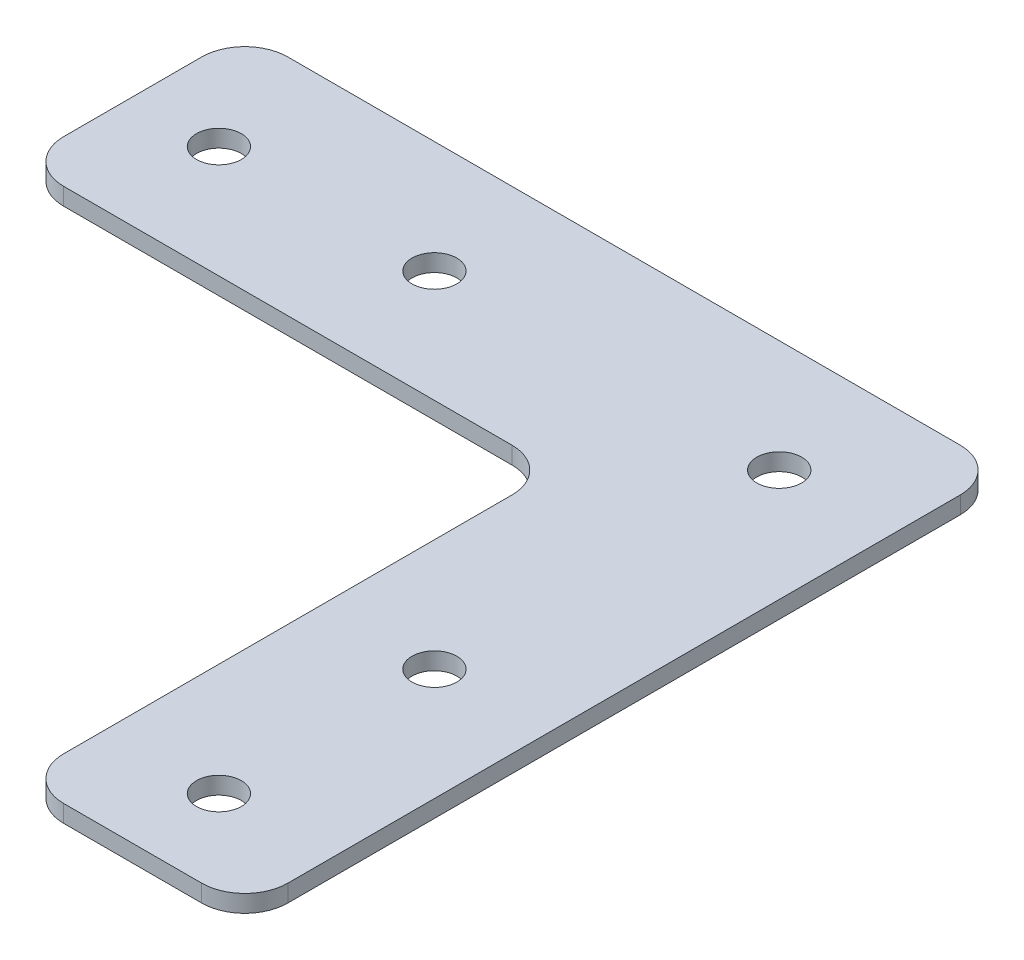
ISO-10303-21;
HEADER;
FILE_DESCRIPTION(('STEP AP214'),'2;1');
FILE_NAME('part.step','',(''),(''),'','','');
FILE_SCHEMA(('AUTOMOTIVE_DESIGN { 1 0 10303 214 1 1 1 1 }'));
ENDSEC;
DATA;
#1=APPLICATION_CONTEXT('core data for automotive mechanical design processes');
#2=APPLICATION_PROTOCOL_DEFINITION('international standard','automotive_design',2000,#1);
#3=PRODUCT_CONTEXT('',#1,'mechanical');
#4=PRODUCT('Part','Part','',(#3));
#5=PRODUCT_RELATED_PRODUCT_CATEGORY('part','',(#4));
#6=PRODUCT_DEFINITION_FORMATION('','',#4);
#7=PRODUCT_DEFINITION_CONTEXT('part definition',#1,'design');
#8=PRODUCT_DEFINITION('design','',#6,#7);
#9=PRODUCT_DEFINITION_SHAPE('','',#8);
#10=(LENGTH_UNIT() NAMED_UNIT(*) SI_UNIT(.MILLI.,.METRE.));
#11=(NAMED_UNIT(*) PLANE_ANGLE_UNIT() SI_UNIT($,.RADIAN.));
#12=(NAMED_UNIT(*) SI_UNIT($,.STERADIAN.) SOLID_ANGLE_UNIT());
#13=UNCERTAINTY_MEASURE_WITH_UNIT(LENGTH_MEASURE(1.E-05),#10,'distance_accuracy_value','');
#14=(GEOMETRIC_REPRESENTATION_CONTEXT(3) GLOBAL_UNCERTAINTY_ASSIGNED_CONTEXT((#13)) GLOBAL_UNIT_ASSIGNED_CONTEXT((#10,
#11,#12)) REPRESENTATION_CONTEXT('',''));
#15=CARTESIAN_POINT('',(0.,0.,0.));
#16=DIRECTION('',(0.,0.,1.));
#17=DIRECTION('',(1.,0.,0.));
#18=AXIS2_PLACEMENT_3D('',#15,#16,#17);
#19=CARTESIAN_POINT('',(8.,2.,-8.00000000000002));
#20=DIRECTION('',(0.,-1.,0.));
#21=DIRECTION('',(0.,0.,-1.));
#22=AXIS2_PLACEMENT_3D('',#19,#20,#21);
#23=PLANE('',#22);
#24=CARTESIAN_POINT('',(0.,2.,65.));
#25=DIRECTION('',(0.,-1.,0.));
#26=DIRECTION('',(0.,0.,-1.));
#27=AXIS2_PLACEMENT_3D('',#24,#25,#26);
#28=CIRCLE('',#27,2.6);
#29=CARTESIAN_POINT('',(0.,2.,62.4));
#30=VERTEX_POINT('',#29);
#31=EDGE_CURVE('E179',#30,#30,#28,.T.);
#32=ORIENTED_EDGE('',*,*,#31,.T.);
#33=EDGE_LOOP('',(#32));
#34=FACE_BOUND('',#33,.T.);
#35=CARTESIAN_POINT('',(0.,2.,40.));
#36=DIRECTION('',(0.,-1.,0.));
#37=DIRECTION('',(0.,0.,-1.));
#38=AXIS2_PLACEMENT_3D('',#35,#36,#37);
#39=CIRCLE('',#38,2.6);
#40=CARTESIAN_POINT('',(0.,2.,37.4));
#41=VERTEX_POINT('',#40);
#42=EDGE_CURVE('E182',#41,#41,#39,.T.);
#43=ORIENTED_EDGE('',*,*,#42,.T.);
#44=EDGE_LOOP('',(#43));
#45=FACE_BOUND('',#44,.T.);
#46=CARTESIAN_POINT('',(-40.,2.,0.));
#47=DIRECTION('',(0.,-1.,0.));
#48=DIRECTION('',(0.,0.,-1.));
#49=AXIS2_PLACEMENT_3D('',#46,#47,#48);
#50=CIRCLE('',#49,2.6);
#51=CARTESIAN_POINT('',(-40.,2.,-2.59999999999999));
#52=VERTEX_POINT('',#51);
#53=EDGE_CURVE('E185',#52,#52,#50,.T.);
#54=ORIENTED_EDGE('',*,*,#53,.T.);
#55=EDGE_LOOP('',(#54));
#56=FACE_BOUND('',#55,.T.);
#57=CARTESIAN_POINT('',(-65.,2.,0.));
#58=DIRECTION('',(0.,-1.,0.));
#59=DIRECTION('',(0.,0.,-1.));
#60=AXIS2_PLACEMENT_3D('',#57,#58,#59);
#61=CIRCLE('',#60,2.6);
#62=CARTESIAN_POINT('',(-65.,2.,-2.6));
#63=VERTEX_POINT('',#62);
#64=EDGE_CURVE('E188',#63,#63,#61,.T.);
#65=ORIENTED_EDGE('',*,*,#64,.T.);
#66=EDGE_LOOP('',(#65));
#67=FACE_BOUND('',#66,.T.);
#68=CARTESIAN_POINT('',(0.,2.,0.));
#69=DIRECTION('',(0.,-1.,0.));
#70=DIRECTION('',(0.,0.,-1.));
#71=AXIS2_PLACEMENT_3D('',#68,#69,#70);
#72=CIRCLE('',#71,2.6);
#73=CARTESIAN_POINT('',(0.,2.,-2.6));
#74=VERTEX_POINT('',#73);
#75=EDGE_CURVE('E123',#74,#74,#72,.T.);
#76=ORIENTED_EDGE('',*,*,#75,.T.);
#77=EDGE_LOOP('',(#76));
#78=FACE_BOUND('',#77,.T.);
#79=DIRECTION('',(1.,0.,0.));
#80=VECTOR('',#79,1.);
#81=CARTESIAN_POINT('',(8.,2.,-13.));
#82=LINE('',#81,#80);
#83=CARTESIAN_POINT('',(8.,2.,-13.));
#84=VERTEX_POINT('',#83);
#85=CARTESIAN_POINT('',(-70.,2.,-13.));
#86=VERTEX_POINT('',#85);
#87=EDGE_CURVE('E107',#84,#86,#82,.F.);
#88=ORIENTED_EDGE('',*,*,#87,.T.);
#89=CARTESIAN_POINT('',(-70.,2.,-7.99999999999999));
#90=DIRECTION('',(0.,-1.,0.));
#91=DIRECTION('',(0.,0.,-1.));
#92=AXIS2_PLACEMENT_3D('',#89,#90,#91);
#93=CIRCLE('',#92,5.00000000000001);
#94=CARTESIAN_POINT('',(-75.,2.,-8.));
#95=VERTEX_POINT('',#94);
#96=EDGE_CURVE('E119',#95,#86,#93,.T.);
#97=ORIENTED_EDGE('',*,*,#96,.F.);
#98=DIRECTION('',(0.,0.,-1.));
#99=VECTOR('',#98,1.);
#100=CARTESIAN_POINT('',(-75.,2.,8.00000000000001));
#101=LINE('',#100,#99);
#102=CARTESIAN_POINT('',(-75.,2.,8.00000000000001));
#103=VERTEX_POINT('',#102);
#104=EDGE_CURVE('E129',#95,#103,#101,.F.);
#105=ORIENTED_EDGE('',*,*,#104,.T.);
#106=CARTESIAN_POINT('',(-70.,2.,8.00000000000001));
#107=DIRECTION('',(0.,-1.,0.));
#108=DIRECTION('',(0.,0.,-1.));
#109=AXIS2_PLACEMENT_3D('',#106,#107,#108);
#110=CIRCLE('',#109,5.);
#111=CARTESIAN_POINT('',(-70.,2.,13.));
#112=VERTEX_POINT('',#111);
#113=EDGE_CURVE('E132',#112,#103,#110,.T.);
#114=ORIENTED_EDGE('',*,*,#113,.F.);
#115=DIRECTION('',(-1.,0.,0.));
#116=VECTOR('',#115,1.);
#117=CARTESIAN_POINT('',(-70.,2.,13.));
#118=LINE('',#117,#116);
#119=CARTESIAN_POINT('',(-18.,2.,13.));
#120=VERTEX_POINT('',#119);
#121=EDGE_CURVE('E133',#112,#120,#118,.F.);
#122=ORIENTED_EDGE('',*,*,#121,.T.);
#123=CARTESIAN_POINT('',(-18.,2.,18.));
#124=DIRECTION('',(0.,-1.,0.));
#125=DIRECTION('',(0.,0.,-1.));
#126=AXIS2_PLACEMENT_3D('',#123,#124,#125);
#127=CIRCLE('',#126,5.);
#128=CARTESIAN_POINT('',(-13.,2.,18.));
#129=VERTEX_POINT('',#128);
#130=EDGE_CURVE('E198',#120,#129,#127,.T.);
#131=ORIENTED_EDGE('',*,*,#130,.T.);
#132=DIRECTION('',(0.,0.,-1.));
#133=VECTOR('',#132,1.);
#134=CARTESIAN_POINT('',(-13.,2.,18.));
#135=LINE('',#134,#133);
#136=CARTESIAN_POINT('',(-13.,2.,70.));
#137=VERTEX_POINT('',#136);
#138=EDGE_CURVE('E137',#129,#137,#135,.F.);
#139=ORIENTED_EDGE('',*,*,#138,.T.);
#140=CARTESIAN_POINT('',(-8.,2.,70.));
#141=DIRECTION('',(0.,-1.,0.));
#142=DIRECTION('',(0.,0.,-1.));
#143=AXIS2_PLACEMENT_3D('',#140,#141,#142);
#144=CIRCLE('',#143,5.);
#145=CARTESIAN_POINT('',(-8.,2.,75.));
#146=VERTEX_POINT('',#145);
#147=EDGE_CURVE('E140',#146,#137,#144,.T.);
#148=ORIENTED_EDGE('',*,*,#147,.F.);
#149=DIRECTION('',(-1.,0.,0.));
#150=VECTOR('',#149,1.);
#151=CARTESIAN_POINT('',(8.,2.,75.));
#152=LINE('',#151,#150);
#153=CARTESIAN_POINT('',(8.,2.,75.));
#154=VERTEX_POINT('',#153);
#155=EDGE_CURVE('E141',#146,#154,#152,.F.);
#156=ORIENTED_EDGE('',*,*,#155,.T.);
#157=CARTESIAN_POINT('',(8.,2.,70.));
#158=DIRECTION('',(0.,-1.,0.));
#159=DIRECTION('',(0.,0.,-1.));
#160=AXIS2_PLACEMENT_3D('',#157,#158,#159);
#161=CIRCLE('',#160,5.);
#162=CARTESIAN_POINT('',(13.,2.,70.));
#163=VERTEX_POINT('',#162);
#164=EDGE_CURVE('E144',#163,#154,#161,.T.);
#165=ORIENTED_EDGE('',*,*,#164,.F.);
#166=DIRECTION('',(0.,0.,1.));
#167=VECTOR('',#166,1.);
#168=CARTESIAN_POINT('',(13.,2.,70.));
#169=LINE('',#168,#167);
#170=CARTESIAN_POINT('',(13.,2.,-8.00000000000002));
#171=VERTEX_POINT('',#170);
#172=EDGE_CURVE('E109',#163,#171,#169,.F.);
#173=ORIENTED_EDGE('',*,*,#172,.T.);
#174=CARTESIAN_POINT('',(8.,2.,-8.00000000000002));
#175=DIRECTION('',(0.,-1.,0.));
#176=DIRECTION('',(0.,0.,-1.));
#177=AXIS2_PLACEMENT_3D('',#174,#175,#176);
#178=CIRCLE('',#177,5.);
#179=EDGE_CURVE('E20',#84,#171,#178,.T.);
#180=ORIENTED_EDGE('',*,*,#179,.F.);
#181=EDGE_LOOP('',(#88,#97,#105,#114,#122,#131,#139,#148,#156,#165,#173,#180));
#182=FACE_BOUND('',#181,.T.);
#183=ADVANCED_FACE('F17',(#34,#45,#56,#67,#78,#182),#23,.F.);
#184=CARTESIAN_POINT('',(8.,2.,-8.00000000000002));
#185=DIRECTION('',(0.,-1.,0.));
#186=DIRECTION('',(0.,0.,-1.));
#187=AXIS2_PLACEMENT_3D('',#184,#185,#186);
#188=CYLINDRICAL_SURFACE('',#187,5.);
#189=DIRECTION('',(0.,1.,0.));
#190=VECTOR('',#189,1.);
#191=CARTESIAN_POINT('',(8.,2.,-13.));
#192=LINE('',#191,#190);
#193=CARTESIAN_POINT('',(8.,0.,-13.));
#194=VERTEX_POINT('',#193);
#195=EDGE_CURVE('E113',#194,#84,#192,.T.);
#196=ORIENTED_EDGE('',*,*,#195,.T.);
#197=ORIENTED_EDGE('',*,*,#179,.T.);
#198=DIRECTION('',(0.,1.,0.));
#199=VECTOR('',#198,1.);
#200=CARTESIAN_POINT('',(13.,2.,-8.00000000000002));
#201=LINE('',#200,#199);
#202=CARTESIAN_POINT('',(13.,0.,-8.00000000000002));
#203=VERTEX_POINT('',#202);
#204=EDGE_CURVE('E127',#171,#203,#201,.F.);
#205=ORIENTED_EDGE('',*,*,#204,.T.);
#206=CARTESIAN_POINT('',(8.,0.,-8.00000000000002));
#207=DIRECTION('',(0.,-1.,0.));
#208=DIRECTION('',(0.,0.,-1.));
#209=AXIS2_PLACEMENT_3D('',#206,#207,#208);
#210=CIRCLE('',#209,5.);
#211=EDGE_CURVE('E116',#194,#203,#210,.T.);
#212=ORIENTED_EDGE('',*,*,#211,.F.);
#213=EDGE_LOOP('',(#196,#197,#205,#212));
#214=FACE_BOUND('',#213,.T.);
#215=ADVANCED_FACE('F114',(#214),#188,.T.);
#216=CARTESIAN_POINT('',(13.,2.,70.));
#217=DIRECTION('',(-1.,0.,0.));
#218=DIRECTION('',(0.,0.,1.));
#219=AXIS2_PLACEMENT_3D('',#216,#217,#218);
#220=PLANE('',#219);
#221=DIRECTION('',(0.,0.,-1.));
#222=VECTOR('',#221,1.);
#223=CARTESIAN_POINT('',(13.,0.,-8.00000000000002));
#224=LINE('',#223,#222);
#225=CARTESIAN_POINT('',(13.,0.,70.));
#226=VERTEX_POINT('',#225);
#227=EDGE_CURVE('E177',#203,#226,#224,.F.);
#228=ORIENTED_EDGE('',*,*,#227,.F.);
#229=ORIENTED_EDGE('',*,*,#204,.F.);
#230=ORIENTED_EDGE('',*,*,#172,.F.);
#231=DIRECTION('',(0.,-1.,0.));
#232=VECTOR('',#231,1.);
#233=CARTESIAN_POINT('',(13.,2.,70.));
#234=LINE('',#233,#232);
#235=EDGE_CURVE('E203',#226,#163,#234,.F.);
#236=ORIENTED_EDGE('',*,*,#235,.F.);
#237=EDGE_LOOP('',(#228,#229,#230,#236));
#238=FACE_BOUND('',#237,.T.);
#239=ADVANCED_FACE('F265',(#238),#220,.F.);
#240=CARTESIAN_POINT('',(8.,2.,70.));
#241=DIRECTION('',(0.,-1.,0.));
#242=DIRECTION('',(0.,0.,-1.));
#243=AXIS2_PLACEMENT_3D('',#240,#241,#242);
#244=CYLINDRICAL_SURFACE('',#243,5.);
#245=ORIENTED_EDGE('',*,*,#235,.T.);
#246=ORIENTED_EDGE('',*,*,#164,.T.);
#247=DIRECTION('',(0.,1.,0.));
#248=VECTOR('',#247,1.);
#249=CARTESIAN_POINT('',(8.,2.,75.));
#250=LINE('',#249,#248);
#251=CARTESIAN_POINT('',(8.,0.,75.));
#252=VERTEX_POINT('',#251);
#253=EDGE_CURVE('E143',#154,#252,#250,.F.);
#254=ORIENTED_EDGE('',*,*,#253,.T.);
#255=CARTESIAN_POINT('',(8.,0.,70.));
#256=DIRECTION('',(0.,-1.,0.));
#257=DIRECTION('',(0.,0.,-1.));
#258=AXIS2_PLACEMENT_3D('',#255,#256,#257);
#259=CIRCLE('',#258,5.);
#260=EDGE_CURVE('E174',#226,#252,#259,.T.);
#261=ORIENTED_EDGE('',*,*,#260,.F.);
#262=EDGE_LOOP('',(#245,#246,#254,#261));
#263=FACE_BOUND('',#262,.T.);
#264=ADVANCED_FACE('F262',(#263),#244,.T.);
#265=CARTESIAN_POINT('',(8.,2.,75.));
#266=DIRECTION('',(0.,0.,-1.));
#267=DIRECTION('',(-1.,0.,0.));
#268=AXIS2_PLACEMENT_3D('',#265,#266,#267);
#269=PLANE('',#268);
#270=DIRECTION('',(1.,0.,0.));
#271=VECTOR('',#270,1.);
#272=CARTESIAN_POINT('',(8.,0.,75.));
#273=LINE('',#272,#271);
#274=CARTESIAN_POINT('',(-8.,0.,75.));
#275=VERTEX_POINT('',#274);
#276=EDGE_CURVE('E173',#252,#275,#273,.F.);
#277=ORIENTED_EDGE('',*,*,#276,.F.);
#278=ORIENTED_EDGE('',*,*,#253,.F.);
#279=ORIENTED_EDGE('',*,*,#155,.F.);
#280=DIRECTION('',(0.,-1.,0.));
#281=VECTOR('',#280,1.);
#282=CARTESIAN_POINT('',(-8.,2.,75.));
#283=LINE('',#282,#281);
#284=EDGE_CURVE('E201',#275,#146,#283,.F.);
#285=ORIENTED_EDGE('',*,*,#284,.F.);
#286=EDGE_LOOP('',(#277,#278,#279,#285));
#287=FACE_BOUND('',#286,.T.);
#288=ADVANCED_FACE('F261',(#287),#269,.F.);
#289=CARTESIAN_POINT('',(-8.,2.,70.));
#290=DIRECTION('',(0.,-1.,0.));
#291=DIRECTION('',(0.,0.,-1.));
#292=AXIS2_PLACEMENT_3D('',#289,#290,#291);
#293=CYLINDRICAL_SURFACE('',#292,5.);
#294=ORIENTED_EDGE('',*,*,#284,.T.);
#295=ORIENTED_EDGE('',*,*,#147,.T.);
#296=DIRECTION('',(0.,1.,0.));
#297=VECTOR('',#296,1.);
#298=CARTESIAN_POINT('',(-13.,2.,70.));
#299=LINE('',#298,#297);
#300=CARTESIAN_POINT('',(-13.,0.,70.));
#301=VERTEX_POINT('',#300);
#302=EDGE_CURVE('E139',#137,#301,#299,.F.);
#303=ORIENTED_EDGE('',*,*,#302,.T.);
#304=CARTESIAN_POINT('',(-8.,0.,70.));
#305=DIRECTION('',(0.,-1.,0.));
#306=DIRECTION('',(0.,0.,-1.));
#307=AXIS2_PLACEMENT_3D('',#304,#305,#306);
#308=CIRCLE('',#307,5.);
#309=EDGE_CURVE('E170',#275,#301,#308,.T.);
#310=ORIENTED_EDGE('',*,*,#309,.F.);
#311=EDGE_LOOP('',(#294,#295,#303,#310));
#312=FACE_BOUND('',#311,.T.);
#313=ADVANCED_FACE('F257',(#312),#293,.T.);
#314=CARTESIAN_POINT('',(-13.,2.,18.));
#315=DIRECTION('',(1.,0.,0.));
#316=DIRECTION('',(0.,0.,-1.));
#317=AXIS2_PLACEMENT_3D('',#314,#315,#316);
#318=PLANE('',#317);
#319=DIRECTION('',(0.,0.,-1.));
#320=VECTOR('',#319,1.);
#321=CARTESIAN_POINT('',(-13.,0.,-8.00000000000002));
#322=LINE('',#321,#320);
#323=CARTESIAN_POINT('',(-13.,0.,18.));
#324=VERTEX_POINT('',#323);
#325=EDGE_CURVE('E169',#301,#324,#322,.T.);
#326=ORIENTED_EDGE('',*,*,#325,.F.);
#327=ORIENTED_EDGE('',*,*,#302,.F.);
#328=ORIENTED_EDGE('',*,*,#138,.F.);
#329=DIRECTION('',(0.,-1.,0.));
#330=VECTOR('',#329,1.);
#331=CARTESIAN_POINT('',(-13.,2.,18.));
#332=LINE('',#331,#330);
#333=EDGE_CURVE('E136',#129,#324,#332,.T.);
#334=ORIENTED_EDGE('',*,*,#333,.T.);
#335=EDGE_LOOP('',(#326,#327,#328,#334));
#336=FACE_BOUND('',#335,.T.);
#337=ADVANCED_FACE('F253',(#336),#318,.F.);
#338=CARTESIAN_POINT('',(-18.,2.,18.));
#339=DIRECTION('',(0.,-1.,0.));
#340=DIRECTION('',(0.,0.,-1.));
#341=AXIS2_PLACEMENT_3D('',#338,#339,#340);
#342=CYLINDRICAL_SURFACE('',#341,5.);
#343=CARTESIAN_POINT('',(-18.,0.,18.));
#344=DIRECTION('',(0.,-1.,0.));
#345=DIRECTION('',(0.,0.,-1.));
#346=AXIS2_PLACEMENT_3D('',#343,#344,#345);
#347=CIRCLE('',#346,5.);
#348=CARTESIAN_POINT('',(-18.,0.,13.));
#349=VERTEX_POINT('',#348);
#350=EDGE_CURVE('E166',#324,#349,#347,.F.);
#351=ORIENTED_EDGE('',*,*,#350,.F.);
#352=ORIENTED_EDGE('',*,*,#333,.F.);
#353=ORIENTED_EDGE('',*,*,#130,.F.);
#354=DIRECTION('',(0.,1.,0.));
#355=VECTOR('',#354,1.);
#356=CARTESIAN_POINT('',(-18.,2.,13.));
#357=LINE('',#356,#355);
#358=EDGE_CURVE('E135',#120,#349,#357,.F.);
#359=ORIENTED_EDGE('',*,*,#358,.T.);
#360=EDGE_LOOP('',(#351,#352,#353,#359));
#361=FACE_BOUND('',#360,.T.);
#362=ADVANCED_FACE('F250',(#361),#342,.F.);
#363=CARTESIAN_POINT('',(-70.,2.,13.));
#364=DIRECTION('',(0.,0.,-1.));
#365=DIRECTION('',(-1.,0.,0.));
#366=AXIS2_PLACEMENT_3D('',#363,#364,#365);
#367=PLANE('',#366);
#368=DIRECTION('',(1.,0.,0.));
#369=VECTOR('',#368,1.);
#370=CARTESIAN_POINT('',(8.,0.,13.));
#371=LINE('',#370,#369);
#372=CARTESIAN_POINT('',(-70.,0.,13.));
#373=VERTEX_POINT('',#372);
#374=EDGE_CURVE('E165',#349,#373,#371,.F.);
#375=ORIENTED_EDGE('',*,*,#374,.F.);
#376=ORIENTED_EDGE('',*,*,#358,.F.);
#377=ORIENTED_EDGE('',*,*,#121,.F.);
#378=DIRECTION('',(0.,-1.,0.));
#379=VECTOR('',#378,1.);
#380=CARTESIAN_POINT('',(-70.,2.,13.));
#381=LINE('',#380,#379);
#382=EDGE_CURVE('E197',#373,#112,#381,.F.);
#383=ORIENTED_EDGE('',*,*,#382,.F.);
#384=EDGE_LOOP('',(#375,#376,#377,#383));
#385=FACE_BOUND('',#384,.T.);
#386=ADVANCED_FACE('F243',(#385),#367,.F.);
#387=CARTESIAN_POINT('',(-70.,2.,8.00000000000001));
#388=DIRECTION('',(0.,-1.,0.));
#389=DIRECTION('',(0.,0.,-1.));
#390=AXIS2_PLACEMENT_3D('',#387,#388,#389);
#391=CYLINDRICAL_SURFACE('',#390,5.);
#392=ORIENTED_EDGE('',*,*,#382,.T.);
#393=ORIENTED_EDGE('',*,*,#113,.T.);
#394=DIRECTION('',(0.,1.,0.));
#395=VECTOR('',#394,1.);
#396=CARTESIAN_POINT('',(-75.,2.,8.00000000000001));
#397=LINE('',#396,#395);
#398=CARTESIAN_POINT('',(-75.,0.,8.00000000000001));
#399=VERTEX_POINT('',#398);
#400=EDGE_CURVE('E131',#103,#399,#397,.F.);
#401=ORIENTED_EDGE('',*,*,#400,.T.);
#402=CARTESIAN_POINT('',(-70.,0.,8.00000000000001));
#403=DIRECTION('',(0.,-1.,0.));
#404=DIRECTION('',(0.,0.,-1.));
#405=AXIS2_PLACEMENT_3D('',#402,#403,#404);
#406=CIRCLE('',#405,5.);
#407=EDGE_CURVE('E162',#373,#399,#406,.T.);
#408=ORIENTED_EDGE('',*,*,#407,.F.);
#409=EDGE_LOOP('',(#392,#393,#401,#408));
#410=FACE_BOUND('',#409,.T.);
#411=ADVANCED_FACE('F239',(#410),#391,.T.);
#412=CARTESIAN_POINT('',(-75.,2.,8.00000000000001));
#413=DIRECTION('',(1.,0.,0.));
#414=DIRECTION('',(0.,0.,-1.));
#415=AXIS2_PLACEMENT_3D('',#412,#413,#414);
#416=PLANE('',#415);
#417=DIRECTION('',(0.,0.,-1.));
#418=VECTOR('',#417,1.);
#419=CARTESIAN_POINT('',(-75.,0.,-8.00000000000002));
#420=LINE('',#419,#418);
#421=CARTESIAN_POINT('',(-75.,0.,-8.));
#422=VERTEX_POINT('',#421);
#423=EDGE_CURVE('E161',#399,#422,#420,.T.);
#424=ORIENTED_EDGE('',*,*,#423,.F.);
#425=ORIENTED_EDGE('',*,*,#400,.F.);
#426=ORIENTED_EDGE('',*,*,#104,.F.);
#427=DIRECTION('',(0.,-1.,0.));
#428=VECTOR('',#427,1.);
#429=CARTESIAN_POINT('',(-75.,2.,-8.));
#430=LINE('',#429,#428);
#431=EDGE_CURVE('E194',#422,#95,#430,.F.);
#432=ORIENTED_EDGE('',*,*,#431,.F.);
#433=EDGE_LOOP('',(#424,#425,#426,#432));
#434=FACE_BOUND('',#433,.T.);
#435=ADVANCED_FACE('F235',(#434),#416,.F.);
#436=CARTESIAN_POINT('',(-70.,2.,-7.99999999999999));
#437=DIRECTION('',(0.,-1.,0.));
#438=DIRECTION('',(0.,0.,-1.));
#439=AXIS2_PLACEMENT_3D('',#436,#437,#438);
#440=CYLINDRICAL_SURFACE('',#439,5.00000000000001);
#441=ORIENTED_EDGE('',*,*,#431,.T.);
#442=ORIENTED_EDGE('',*,*,#96,.T.);
#443=DIRECTION('',(0.,1.,0.));
#444=VECTOR('',#443,1.);
#445=CARTESIAN_POINT('',(-70.,2.,-13.));
#446=LINE('',#445,#444);
#447=CARTESIAN_POINT('',(-70.,0.,-13.));
#448=VERTEX_POINT('',#447);
#449=EDGE_CURVE('E35',#86,#448,#446,.F.);
#450=ORIENTED_EDGE('',*,*,#449,.T.);
#451=CARTESIAN_POINT('',(-70.,0.,-7.99999999999999));
#452=DIRECTION('',(0.,-1.,0.));
#453=DIRECTION('',(0.,0.,-1.));
#454=AXIS2_PLACEMENT_3D('',#451,#452,#453);
#455=CIRCLE('',#454,5.00000000000001);
#456=EDGE_CURVE('E158',#422,#448,#455,.T.);
#457=ORIENTED_EDGE('',*,*,#456,.F.);
#458=EDGE_LOOP('',(#441,#442,#450,#457));
#459=FACE_BOUND('',#458,.T.);
#460=ADVANCED_FACE('F233',(#459),#440,.T.);
#461=CARTESIAN_POINT('',(8.,2.,-13.));
#462=DIRECTION('',(0.,0.,1.));
#463=DIRECTION('',(1.,0.,0.));
#464=AXIS2_PLACEMENT_3D('',#461,#462,#463);
#465=PLANE('',#464);
#466=ORIENTED_EDGE('',*,*,#449,.F.);
#467=ORIENTED_EDGE('',*,*,#87,.F.);
#468=ORIENTED_EDGE('',*,*,#195,.F.);
#469=DIRECTION('',(1.,0.,0.));
#470=VECTOR('',#469,1.);
#471=CARTESIAN_POINT('',(8.,0.,-13.));
#472=LINE('',#471,#470);
#473=EDGE_CURVE('E157',#448,#194,#472,.T.);
#474=ORIENTED_EDGE('',*,*,#473,.F.);
#475=EDGE_LOOP('',(#466,#467,#468,#474));
#476=FACE_BOUND('',#475,.T.);
#477=ADVANCED_FACE('F121',(#476),#465,.F.);
#478=CARTESIAN_POINT('',(0.,2.,0.));
#479=DIRECTION('',(0.,-1.,0.));
#480=DIRECTION('',(0.,0.,-1.));
#481=AXIS2_PLACEMENT_3D('',#478,#479,#480);
#482=CYLINDRICAL_SURFACE('',#481,2.6);
#483=ORIENTED_EDGE('',*,*,#75,.F.);
#484=EDGE_LOOP('',(#483));
#485=FACE_BOUND('',#484,.T.);
#486=CARTESIAN_POINT('',(0.,0.,0.));
#487=DIRECTION('',(0.,-1.,0.));
#488=DIRECTION('',(0.,0.,-1.));
#489=AXIS2_PLACEMENT_3D('',#486,#487,#488);
#490=CIRCLE('',#489,2.6);
#491=CARTESIAN_POINT('',(0.,0.,-2.6));
#492=VERTEX_POINT('',#491);
#493=EDGE_CURVE('E154',#492,#492,#490,.F.);
#494=ORIENTED_EDGE('',*,*,#493,.F.);
#495=EDGE_LOOP('',(#494));
#496=FACE_BOUND('',#495,.T.);
#497=ADVANCED_FACE('F296',(#485,#496),#482,.F.);
#498=CARTESIAN_POINT('',(-65.,2.,0.));
#499=DIRECTION('',(0.,-1.,0.));
#500=DIRECTION('',(0.,0.,-1.));
#501=AXIS2_PLACEMENT_3D('',#498,#499,#500);
#502=CYLINDRICAL_SURFACE('',#501,2.6);
#503=ORIENTED_EDGE('',*,*,#64,.F.);
#504=EDGE_LOOP('',(#503));
#505=FACE_BOUND('',#504,.T.);
#506=CARTESIAN_POINT('',(-65.,0.,0.));
#507=DIRECTION('',(0.,-1.,0.));
#508=DIRECTION('',(0.,0.,-1.));
#509=AXIS2_PLACEMENT_3D('',#506,#507,#508);
#510=CIRCLE('',#509,2.6);
#511=CARTESIAN_POINT('',(-65.,0.,-2.6));
#512=VERTEX_POINT('',#511);
#513=EDGE_CURVE('E151',#512,#512,#510,.F.);
#514=ORIENTED_EDGE('',*,*,#513,.F.);
#515=EDGE_LOOP('',(#514));
#516=FACE_BOUND('',#515,.T.);
#517=ADVANCED_FACE('F292',(#505,#516),#502,.F.);
#518=CARTESIAN_POINT('',(-40.,2.,0.));
#519=DIRECTION('',(0.,-1.,0.));
#520=DIRECTION('',(0.,0.,-1.));
#521=AXIS2_PLACEMENT_3D('',#518,#519,#520);
#522=CYLINDRICAL_SURFACE('',#521,2.6);
#523=ORIENTED_EDGE('',*,*,#53,.F.);
#524=EDGE_LOOP('',(#523));
#525=FACE_BOUND('',#524,.T.);
#526=CARTESIAN_POINT('',(-40.,0.,0.));
#527=DIRECTION('',(0.,-1.,0.));
#528=DIRECTION('',(0.,0.,-1.));
#529=AXIS2_PLACEMENT_3D('',#526,#527,#528);
#530=CIRCLE('',#529,2.6);
#531=CARTESIAN_POINT('',(-40.,0.,-2.59999999999999));
#532=VERTEX_POINT('',#531);
#533=EDGE_CURVE('E148',#532,#532,#530,.F.);
#534=ORIENTED_EDGE('',*,*,#533,.F.);
#535=EDGE_LOOP('',(#534));
#536=FACE_BOUND('',#535,.T.);
#537=ADVANCED_FACE('F288',(#525,#536),#522,.F.);
#538=CARTESIAN_POINT('',(0.,2.,40.));
#539=DIRECTION('',(0.,-1.,0.));
#540=DIRECTION('',(0.,0.,-1.));
#541=AXIS2_PLACEMENT_3D('',#538,#539,#540);
#542=CYLINDRICAL_SURFACE('',#541,2.6);
#543=ORIENTED_EDGE('',*,*,#42,.F.);
#544=EDGE_LOOP('',(#543));
#545=FACE_BOUND('',#544,.T.);
#546=CARTESIAN_POINT('',(0.,0.,40.));
#547=DIRECTION('',(0.,-1.,0.));
#548=DIRECTION('',(0.,0.,-1.));
#549=AXIS2_PLACEMENT_3D('',#546,#547,#548);
#550=CIRCLE('',#549,2.6);
#551=CARTESIAN_POINT('',(0.,0.,37.4));
#552=VERTEX_POINT('',#551);
#553=EDGE_CURVE('E26',#552,#552,#550,.F.);
#554=ORIENTED_EDGE('',*,*,#553,.F.);
#555=EDGE_LOOP('',(#554));
#556=FACE_BOUND('',#555,.T.);
#557=ADVANCED_FACE('F281',(#545,#556),#542,.F.);
#558=CARTESIAN_POINT('',(0.,2.,65.));
#559=DIRECTION('',(0.,-1.,0.));
#560=DIRECTION('',(0.,0.,-1.));
#561=AXIS2_PLACEMENT_3D('',#558,#559,#560);
#562=CYLINDRICAL_SURFACE('',#561,2.6);
#563=ORIENTED_EDGE('',*,*,#31,.F.);
#564=EDGE_LOOP('',(#563));
#565=FACE_BOUND('',#564,.T.);
#566=CARTESIAN_POINT('',(0.,0.,65.));
#567=DIRECTION('',(0.,-1.,0.));
#568=DIRECTION('',(0.,0.,-1.));
#569=AXIS2_PLACEMENT_3D('',#566,#567,#568);
#570=CIRCLE('',#569,2.6);
#571=CARTESIAN_POINT('',(0.,0.,62.4));
#572=VERTEX_POINT('',#571);
#573=EDGE_CURVE('E11',#572,#572,#570,.F.);
#574=ORIENTED_EDGE('',*,*,#573,.F.);
#575=EDGE_LOOP('',(#574));
#576=FACE_BOUND('',#575,.T.);
#577=ADVANCED_FACE('F275',(#565,#576),#562,.F.);
#578=CARTESIAN_POINT('',(8.,0.,-8.00000000000002));
#579=DIRECTION('',(0.,-1.,0.));
#580=DIRECTION('',(0.,0.,-1.));
#581=AXIS2_PLACEMENT_3D('',#578,#579,#580);
#582=PLANE('',#581);
#583=ORIENTED_EDGE('',*,*,#573,.T.);
#584=EDGE_LOOP('',(#583));
#585=FACE_BOUND('',#584,.T.);
#586=ORIENTED_EDGE('',*,*,#553,.T.);
#587=EDGE_LOOP('',(#586));
#588=FACE_BOUND('',#587,.T.);
#589=ORIENTED_EDGE('',*,*,#533,.T.);
#590=EDGE_LOOP('',(#589));
#591=FACE_BOUND('',#590,.T.);
#592=ORIENTED_EDGE('',*,*,#513,.T.);
#593=EDGE_LOOP('',(#592));
#594=FACE_BOUND('',#593,.T.);
#595=ORIENTED_EDGE('',*,*,#493,.T.);
#596=EDGE_LOOP('',(#595));
#597=FACE_BOUND('',#596,.T.);
#598=ORIENTED_EDGE('',*,*,#456,.T.);
#599=ORIENTED_EDGE('',*,*,#473,.T.);
#600=ORIENTED_EDGE('',*,*,#211,.T.);
#601=ORIENTED_EDGE('',*,*,#227,.T.);
#602=ORIENTED_EDGE('',*,*,#260,.T.);
#603=ORIENTED_EDGE('',*,*,#276,.T.);
#604=ORIENTED_EDGE('',*,*,#309,.T.);
#605=ORIENTED_EDGE('',*,*,#325,.T.);
#606=ORIENTED_EDGE('',*,*,#350,.T.);
#607=ORIENTED_EDGE('',*,*,#374,.T.);
#608=ORIENTED_EDGE('',*,*,#407,.T.);
#609=ORIENTED_EDGE('',*,*,#423,.T.);
#610=EDGE_LOOP('',(#598,#599,#600,#601,#602,#603,#604,#605,#606,#607,#608,#609));
#611=FACE_BOUND('',#610,.T.);
#612=ADVANCED_FACE('F231',(#585,#588,#591,#594,#597,#611),#582,.T.);
#613=CLOSED_SHELL('',(#183,#215,#239,#264,#288,#313,#337,#362,#386,#411,#435,#460,#477,#497,
#517,#537,#557,#577,#612));
#614=MANIFOLD_SOLID_BREP('B1',#613);
#615=ADVANCED_BREP_SHAPE_REPRESENTATION('',(#18,#614),#14);
#616=SHAPE_DEFINITION_REPRESENTATION(#9,#615);
ENDSEC;
END-ISO-10303-21;
